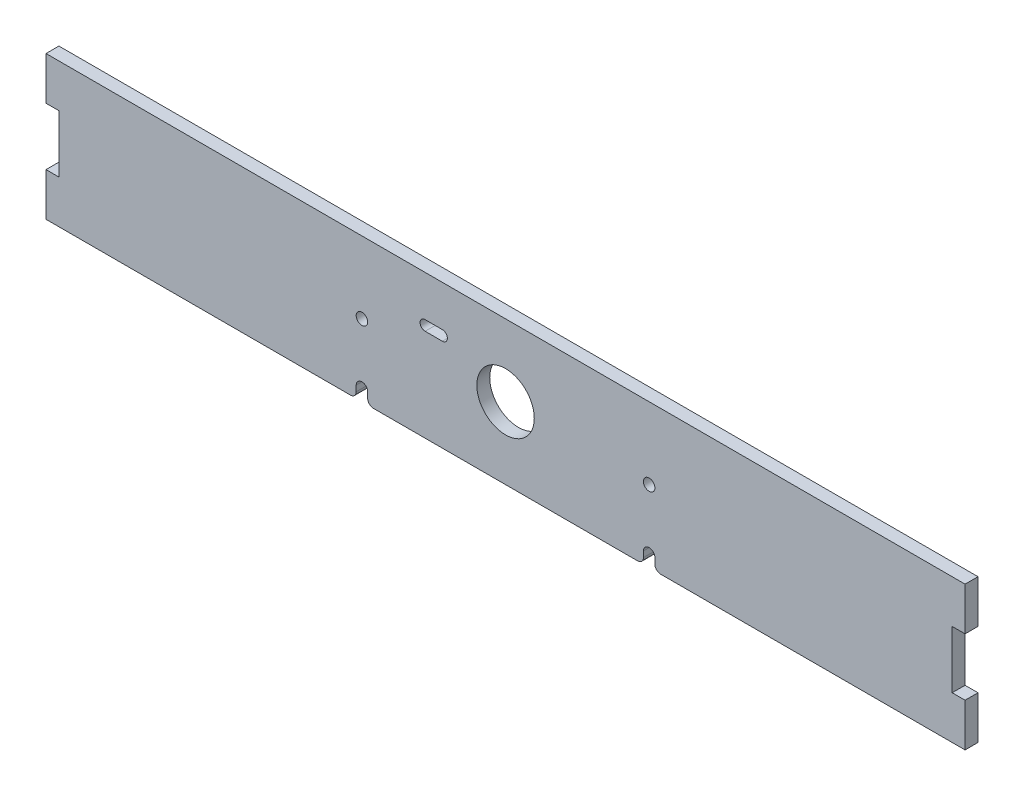
ISO-10303-21;
HEADER;
FILE_DESCRIPTION(('STEP AP214'),'2;1');
FILE_NAME('part.step','',(''),(''),'','','');
FILE_SCHEMA(('AUTOMOTIVE_DESIGN { 1 0 10303 214 1 1 1 1 }'));
ENDSEC;
DATA;
#1=APPLICATION_CONTEXT('core data for automotive mechanical design processes');
#2=APPLICATION_PROTOCOL_DEFINITION('international standard','automotive_design',2000,#1);
#3=PRODUCT_CONTEXT('',#1,'mechanical');
#4=PRODUCT('Part','Part','',(#3));
#5=PRODUCT_RELATED_PRODUCT_CATEGORY('part','',(#4));
#6=PRODUCT_DEFINITION_FORMATION('','',#4);
#7=PRODUCT_DEFINITION_CONTEXT('part definition',#1,'design');
#8=PRODUCT_DEFINITION('design','',#6,#7);
#9=PRODUCT_DEFINITION_SHAPE('','',#8);
#10=(LENGTH_UNIT() NAMED_UNIT(*) SI_UNIT(.MILLI.,.METRE.));
#11=(NAMED_UNIT(*) PLANE_ANGLE_UNIT() SI_UNIT($,.RADIAN.));
#12=(NAMED_UNIT(*) SI_UNIT($,.STERADIAN.) SOLID_ANGLE_UNIT());
#13=UNCERTAINTY_MEASURE_WITH_UNIT(LENGTH_MEASURE(1.E-05),#10,'distance_accuracy_value','');
#14=(GEOMETRIC_REPRESENTATION_CONTEXT(3) GLOBAL_UNCERTAINTY_ASSIGNED_CONTEXT((#13)) GLOBAL_UNIT_ASSIGNED_CONTEXT((#10,
#11,#12)) REPRESENTATION_CONTEXT('',''));
#15=CARTESIAN_POINT('',(0.,0.,0.));
#16=DIRECTION('',(0.,0.,1.));
#17=DIRECTION('',(1.,0.,0.));
#18=AXIS2_PLACEMENT_3D('',#15,#16,#17);
#19=CARTESIAN_POINT('',(203.2,-31.75,5.715));
#20=DIRECTION('',(-1.,0.,0.));
#21=DIRECTION('',(0.,0.,1.));
#22=AXIS2_PLACEMENT_3D('',#19,#20,#21);
#23=PLANE('',#22);
#24=DIRECTION('',(0.,0.,1.));
#25=VECTOR('',#24,1.);
#26=CARTESIAN_POINT('',(203.2,-12.7,0.));
#27=LINE('',#26,#25);
#28=CARTESIAN_POINT('',(203.2,-12.7,0.));
#29=VERTEX_POINT('',#28);
#30=CARTESIAN_POINT('',(203.2,-12.7,5.715));
#31=VERTEX_POINT('',#30);
#32=EDGE_CURVE('E450',#29,#31,#27,.T.);
#33=ORIENTED_EDGE('',*,*,#32,.T.);
#34=DIRECTION('',(0.,1.,0.));
#35=VECTOR('',#34,1.);
#36=CARTESIAN_POINT('',(203.2,-31.75,5.715));
#37=LINE('',#36,#35);
#38=CARTESIAN_POINT('',(203.2,-31.75,5.715));
#39=VERTEX_POINT('',#38);
#40=EDGE_CURVE('E369',#39,#31,#37,.T.);
#41=ORIENTED_EDGE('',*,*,#40,.F.);
#42=DIRECTION('',(0.,0.,-1.));
#43=VECTOR('',#42,1.);
#44=CARTESIAN_POINT('',(203.2,-31.75,5.715));
#45=LINE('',#44,#43);
#46=CARTESIAN_POINT('',(203.2,-31.75,0.));
#47=VERTEX_POINT('',#46);
#48=EDGE_CURVE('E259',#39,#47,#45,.T.);
#49=ORIENTED_EDGE('',*,*,#48,.T.);
#50=DIRECTION('',(0.,1.,0.));
#51=VECTOR('',#50,1.);
#52=CARTESIAN_POINT('',(203.2,-31.75,0.));
#53=LINE('',#52,#51);
#54=EDGE_CURVE('E238',#47,#29,#53,.T.);
#55=ORIENTED_EDGE('',*,*,#54,.T.);
#56=EDGE_LOOP('',(#33,#41,#49,#55));
#57=FACE_BOUND('',#56,.T.);
#58=ADVANCED_FACE('F32',(#57),#23,.F.);
#59=DIRECTION('',(0.,0.,1.));
#60=VECTOR('',#59,1.);
#61=CARTESIAN_POINT('',(203.2,12.7,0.));
#62=LINE('',#61,#60);
#63=CARTESIAN_POINT('',(203.2,12.7,0.));
#64=VERTEX_POINT('',#63);
#65=CARTESIAN_POINT('',(203.2,12.7,5.715));
#66=VERTEX_POINT('',#65);
#67=EDGE_CURVE('E217',#64,#66,#62,.T.);
#68=ORIENTED_EDGE('',*,*,#67,.F.);
#69=CARTESIAN_POINT('',(203.2,31.75,0.));
#70=VERTEX_POINT('',#69);
#71=EDGE_CURVE('E229',#64,#70,#53,.T.);
#72=ORIENTED_EDGE('',*,*,#71,.T.);
#73=DIRECTION('',(0.,0.,-1.));
#74=VECTOR('',#73,1.);
#75=CARTESIAN_POINT('',(203.2,31.75,5.715));
#76=LINE('',#75,#74);
#77=CARTESIAN_POINT('',(203.2,31.75,5.715));
#78=VERTEX_POINT('',#77);
#79=EDGE_CURVE('E268',#78,#70,#76,.T.);
#80=ORIENTED_EDGE('',*,*,#79,.F.);
#81=EDGE_CURVE('E231',#66,#78,#37,.T.);
#82=ORIENTED_EDGE('',*,*,#81,.F.);
#83=EDGE_LOOP('',(#68,#72,#80,#82));
#84=FACE_BOUND('',#83,.T.);
#85=ADVANCED_FACE('F227',(#84),#23,.F.);
#86=CARTESIAN_POINT('',(0.,0.,5.715));
#87=DIRECTION('',(0.,0.,-1.));
#88=DIRECTION('',(-1.,0.,0.));
#89=AXIS2_PLACEMENT_3D('',#86,#87,#88);
#90=PLANE('',#89);
#91=CARTESIAN_POINT('',(0.,0.,5.715));
#92=DIRECTION('',(0.,0.,1.));
#93=DIRECTION('',(1.,0.,0.));
#94=AXIS2_PLACEMENT_3D('',#91,#92,#93);
#95=CIRCLE('',#94,12.7);
#96=CARTESIAN_POINT('',(12.7,0.,5.715));
#97=VERTEX_POINT('',#96);
#98=EDGE_CURVE('E243',#97,#97,#95,.T.);
#99=ORIENTED_EDGE('',*,*,#98,.F.);
#100=EDGE_LOOP('',(#99));
#101=FACE_BOUND('',#100,.T.);
#102=CARTESIAN_POINT('',(-63.5,0.,5.715));
#103=DIRECTION('',(0.,0.,1.));
#104=DIRECTION('',(1.,0.,0.));
#105=AXIS2_PLACEMENT_3D('',#102,#103,#104);
#106=CIRCLE('',#105,2.54);
#107=CARTESIAN_POINT('',(-60.96,0.,5.715));
#108=VERTEX_POINT('',#107);
#109=EDGE_CURVE('E373',#108,#108,#106,.T.);
#110=ORIENTED_EDGE('',*,*,#109,.F.);
#111=EDGE_LOOP('',(#110));
#112=FACE_BOUND('',#111,.T.);
#113=CARTESIAN_POINT('',(63.5,0.,5.715));
#114=DIRECTION('',(0.,0.,1.));
#115=DIRECTION('',(1.,0.,0.));
#116=AXIS2_PLACEMENT_3D('',#113,#114,#115);
#117=CIRCLE('',#116,2.54);
#118=CARTESIAN_POINT('',(66.04,0.,5.715));
#119=VERTEX_POINT('',#118);
#120=EDGE_CURVE('E377',#119,#119,#117,.T.);
#121=ORIENTED_EDGE('',*,*,#120,.F.);
#122=EDGE_LOOP('',(#121));
#123=FACE_BOUND('',#122,.T.);
#124=DIRECTION('',(1.,0.,0.));
#125=VECTOR('',#124,1.);
#126=CARTESIAN_POINT('',(-35.56,9.2075,5.715));
#127=LINE('',#126,#125);
#128=CARTESIAN_POINT('',(-35.56,9.2075,5.715));
#129=VERTEX_POINT('',#128);
#130=CARTESIAN_POINT('',(-27.94,9.2075,5.715));
#131=VERTEX_POINT('',#130);
#132=EDGE_CURVE('E416',#129,#131,#127,.T.);
#133=ORIENTED_EDGE('',*,*,#132,.F.);
#134=CARTESIAN_POINT('',(-35.56,11.43,5.715));
#135=DIRECTION('',(0.,0.,1.));
#136=DIRECTION('',(1.,0.,0.));
#137=AXIS2_PLACEMENT_3D('',#134,#135,#136);
#138=CIRCLE('',#137,2.2225);
#139=CARTESIAN_POINT('',(-35.56,13.6525,5.715));
#140=VERTEX_POINT('',#139);
#141=EDGE_CURVE('E419',#140,#129,#138,.T.);
#142=ORIENTED_EDGE('',*,*,#141,.F.);
#143=DIRECTION('',(-1.,0.,0.));
#144=VECTOR('',#143,1.);
#145=CARTESIAN_POINT('',(-35.56,13.6525,5.715));
#146=LINE('',#145,#144);
#147=CARTESIAN_POINT('',(-27.94,13.6525,5.715));
#148=VERTEX_POINT('',#147);
#149=EDGE_CURVE('E409',#148,#140,#146,.T.);
#150=ORIENTED_EDGE('',*,*,#149,.F.);
#151=CARTESIAN_POINT('',(-27.94,11.43,5.715));
#152=DIRECTION('',(0.,0.,1.));
#153=DIRECTION('',(1.,0.,0.));
#154=AXIS2_PLACEMENT_3D('',#151,#152,#153);
#155=CIRCLE('',#154,2.2225);
#156=EDGE_CURVE('E413',#131,#148,#155,.T.);
#157=ORIENTED_EDGE('',*,*,#156,.F.);
#158=EDGE_LOOP('',(#133,#142,#150,#157));
#159=FACE_BOUND('',#158,.T.);
#160=DIRECTION('',(-1.,0.,0.));
#161=VECTOR('',#160,1.);
#162=CARTESIAN_POINT('',(203.2,-12.7,5.715));
#163=LINE('',#162,#161);
#164=CARTESIAN_POINT('',(197.485,-12.7,5.715));
#165=VERTEX_POINT('',#164);
#166=EDGE_CURVE('E223',#31,#165,#163,.T.);
#167=ORIENTED_EDGE('',*,*,#166,.T.);
#168=DIRECTION('',(0.,1.,0.));
#169=VECTOR('',#168,1.);
#170=CARTESIAN_POINT('',(197.485,12.7,5.715));
#171=LINE('',#170,#169);
#172=CARTESIAN_POINT('',(197.485,12.7,5.715));
#173=VERTEX_POINT('',#172);
#174=EDGE_CURVE('E462',#165,#173,#171,.T.);
#175=ORIENTED_EDGE('',*,*,#174,.T.);
#176=DIRECTION('',(1.,0.,0.));
#177=VECTOR('',#176,1.);
#178=CARTESIAN_POINT('',(203.2,12.7,5.715));
#179=LINE('',#178,#177);
#180=EDGE_CURVE('E465',#173,#66,#179,.T.);
#181=ORIENTED_EDGE('',*,*,#180,.T.);
#182=ORIENTED_EDGE('',*,*,#81,.T.);
#183=DIRECTION('',(-1.,0.,0.));
#184=VECTOR('',#183,1.);
#185=CARTESIAN_POINT('',(-203.2,31.75,5.715));
#186=LINE('',#185,#184);
#187=CARTESIAN_POINT('',(-203.2,31.75,5.715));
#188=VERTEX_POINT('',#187);
#189=EDGE_CURVE('E366',#78,#188,#186,.T.);
#190=ORIENTED_EDGE('',*,*,#189,.T.);
#191=DIRECTION('',(0.,-1.,0.));
#192=VECTOR('',#191,1.);
#193=CARTESIAN_POINT('',(-203.2,-31.75,5.715));
#194=LINE('',#193,#192);
#195=CARTESIAN_POINT('',(-203.2,12.7,5.715));
#196=VERTEX_POINT('',#195);
#197=EDGE_CURVE('E359',#188,#196,#194,.T.);
#198=ORIENTED_EDGE('',*,*,#197,.T.);
#199=DIRECTION('',(-1.,0.,0.));
#200=VECTOR('',#199,1.);
#201=CARTESIAN_POINT('',(-203.2,12.7,5.715));
#202=LINE('',#201,#200);
#203=CARTESIAN_POINT('',(-197.485,12.7,5.715));
#204=VERTEX_POINT('',#203);
#205=EDGE_CURVE('E441',#204,#196,#202,.T.);
#206=ORIENTED_EDGE('',*,*,#205,.F.);
#207=DIRECTION('',(0.,1.,0.));
#208=VECTOR('',#207,1.);
#209=CARTESIAN_POINT('',(-197.485,12.7,5.715));
#210=LINE('',#209,#208);
#211=CARTESIAN_POINT('',(-197.485,-12.7,5.715));
#212=VERTEX_POINT('',#211);
#213=EDGE_CURVE('E444',#212,#204,#210,.T.);
#214=ORIENTED_EDGE('',*,*,#213,.F.);
#215=DIRECTION('',(1.,0.,0.));
#216=VECTOR('',#215,1.);
#217=CARTESIAN_POINT('',(-203.2,-12.7,5.715));
#218=LINE('',#217,#216);
#219=CARTESIAN_POINT('',(-203.2,-12.7,5.715));
#220=VERTEX_POINT('',#219);
#221=EDGE_CURVE('E447',#220,#212,#218,.T.);
#222=ORIENTED_EDGE('',*,*,#221,.F.);
#223=CARTESIAN_POINT('',(-203.2,-31.75,5.715));
#224=VERTEX_POINT('',#223);
#225=EDGE_CURVE('E354',#220,#224,#194,.T.);
#226=ORIENTED_EDGE('',*,*,#225,.T.);
#227=DIRECTION('',(1.,0.,0.));
#228=VECTOR('',#227,1.);
#229=CARTESIAN_POINT('',(-203.2,-31.75,5.715));
#230=LINE('',#229,#228);
#231=CARTESIAN_POINT('',(-68.58,-31.75,5.715));
#232=VERTEX_POINT('',#231);
#233=EDGE_CURVE('E247',#224,#232,#230,.T.);
#234=ORIENTED_EDGE('',*,*,#233,.T.);
#235=CARTESIAN_POINT('',(-68.58,-29.21,5.715));
#236=DIRECTION('',(0.,0.,-1.));
#237=DIRECTION('',(-1.,0.,0.));
#238=AXIS2_PLACEMENT_3D('',#235,#236,#237);
#239=CIRCLE('',#238,2.54);
#240=CARTESIAN_POINT('',(-66.04,-29.21,5.715));
#241=VERTEX_POINT('',#240);
#242=EDGE_CURVE('E304',#232,#241,#239,.F.);
#243=ORIENTED_EDGE('',*,*,#242,.T.);
#244=DIRECTION('',(0.,1.,0.));
#245=VECTOR('',#244,1.);
#246=CARTESIAN_POINT('',(-66.04,0.,5.715));
#247=LINE('',#246,#245);
#248=CARTESIAN_POINT('',(-66.04,-26.67,5.715));
#249=VERTEX_POINT('',#248);
#250=EDGE_CURVE('E274',#241,#249,#247,.T.);
#251=ORIENTED_EDGE('',*,*,#250,.T.);
#252=CARTESIAN_POINT('',(-63.5,-26.67,5.715));
#253=DIRECTION('',(0.,0.,1.));
#254=DIRECTION('',(1.,0.,0.));
#255=AXIS2_PLACEMENT_3D('',#252,#253,#254);
#256=CIRCLE('',#255,2.54);
#257=CARTESIAN_POINT('',(-60.96,-26.67,5.715));
#258=VERTEX_POINT('',#257);
#259=EDGE_CURVE('E280',#258,#249,#256,.T.);
#260=ORIENTED_EDGE('',*,*,#259,.F.);
#261=DIRECTION('',(0.,-1.,0.));
#262=VECTOR('',#261,1.);
#263=CARTESIAN_POINT('',(-60.96,0.,5.715));
#264=LINE('',#263,#262);
#265=CARTESIAN_POINT('',(-60.96,-29.21,5.715));
#266=VERTEX_POINT('',#265);
#267=EDGE_CURVE('E276',#258,#266,#264,.T.);
#268=ORIENTED_EDGE('',*,*,#267,.T.);
#269=CARTESIAN_POINT('',(-58.42,-29.21,5.715));
#270=DIRECTION('',(0.,0.,-1.));
#271=DIRECTION('',(-1.,0.,0.));
#272=AXIS2_PLACEMENT_3D('',#269,#270,#271);
#273=CIRCLE('',#272,2.54);
#274=CARTESIAN_POINT('',(-58.42,-31.75,5.715));
#275=VERTEX_POINT('',#274);
#276=EDGE_CURVE('E302',#266,#275,#273,.F.);
#277=ORIENTED_EDGE('',*,*,#276,.T.);
#278=CARTESIAN_POINT('',(58.42,-31.75,5.715));
#279=VERTEX_POINT('',#278);
#280=EDGE_CURVE('E356',#275,#279,#230,.T.);
#281=ORIENTED_EDGE('',*,*,#280,.T.);
#282=CARTESIAN_POINT('',(58.42,-29.21,5.715));
#283=DIRECTION('',(0.,0.,-1.));
#284=DIRECTION('',(-1.,0.,0.));
#285=AXIS2_PLACEMENT_3D('',#282,#283,#284);
#286=CIRCLE('',#285,2.54);
#287=CARTESIAN_POINT('',(60.96,-29.21,5.715));
#288=VERTEX_POINT('',#287);
#289=EDGE_CURVE('E308',#279,#288,#286,.F.);
#290=ORIENTED_EDGE('',*,*,#289,.T.);
#291=DIRECTION('',(0.,1.,0.));
#292=VECTOR('',#291,1.);
#293=CARTESIAN_POINT('',(60.96,0.,5.715));
#294=LINE('',#293,#292);
#295=CARTESIAN_POINT('',(60.96,-26.67,5.715));
#296=VERTEX_POINT('',#295);
#297=EDGE_CURVE('E287',#288,#296,#294,.T.);
#298=ORIENTED_EDGE('',*,*,#297,.T.);
#299=CARTESIAN_POINT('',(63.5,-26.67,5.715));
#300=DIRECTION('',(0.,0.,1.));
#301=DIRECTION('',(1.,0.,0.));
#302=AXIS2_PLACEMENT_3D('',#299,#300,#301);
#303=CIRCLE('',#302,2.54000000000001);
#304=CARTESIAN_POINT('',(66.04,-26.67,5.715));
#305=VERTEX_POINT('',#304);
#306=EDGE_CURVE('E293',#305,#296,#303,.T.);
#307=ORIENTED_EDGE('',*,*,#306,.F.);
#308=DIRECTION('',(0.,-1.,0.));
#309=VECTOR('',#308,1.);
#310=CARTESIAN_POINT('',(66.04,0.,5.715));
#311=LINE('',#310,#309);
#312=CARTESIAN_POINT('',(66.04,-29.21,5.715));
#313=VERTEX_POINT('',#312);
#314=EDGE_CURVE('E289',#305,#313,#311,.T.);
#315=ORIENTED_EDGE('',*,*,#314,.T.);
#316=CARTESIAN_POINT('',(68.58,-29.21,5.715));
#317=DIRECTION('',(0.,0.,-1.));
#318=DIRECTION('',(-1.,0.,0.));
#319=AXIS2_PLACEMENT_3D('',#316,#317,#318);
#320=CIRCLE('',#319,2.54);
#321=CARTESIAN_POINT('',(68.58,-31.75,5.715));
#322=VERTEX_POINT('',#321);
#323=EDGE_CURVE('E306',#313,#322,#320,.F.);
#324=ORIENTED_EDGE('',*,*,#323,.T.);
#325=EDGE_CURVE('E357',#322,#39,#230,.T.);
#326=ORIENTED_EDGE('',*,*,#325,.T.);
#327=ORIENTED_EDGE('',*,*,#40,.T.);
#328=EDGE_LOOP('',(#167,#175,#181,#182,#190,#198,#206,#214,#222,#226,#234,#243,#251,#260,#268,
#277,#281,#290,#298,#307,#315,#324,#326,#327));
#329=FACE_BOUND('',#328,.T.);
#330=ADVANCED_FACE('F351',(#101,#112,#123,#159,#329),#90,.F.);
#331=CARTESIAN_POINT('',(0.,0.,0.));
#332=DIRECTION('',(0.,0.,-1.));
#333=DIRECTION('',(-1.,0.,0.));
#334=AXIS2_PLACEMENT_3D('',#331,#332,#333);
#335=PLANE('',#334);
#336=CARTESIAN_POINT('',(-35.56,11.43,0.));
#337=DIRECTION('',(0.,0.,1.));
#338=DIRECTION('',(1.,0.,0.));
#339=AXIS2_PLACEMENT_3D('',#336,#337,#338);
#340=CIRCLE('',#339,2.2225);
#341=CARTESIAN_POINT('',(-35.56,13.6525,0.));
#342=VERTEX_POINT('',#341);
#343=CARTESIAN_POINT('',(-35.56,9.2075,0.));
#344=VERTEX_POINT('',#343);
#345=EDGE_CURVE('E412',#342,#344,#340,.T.);
#346=ORIENTED_EDGE('',*,*,#345,.T.);
#347=DIRECTION('',(1.,0.,0.));
#348=VECTOR('',#347,1.);
#349=CARTESIAN_POINT('',(-35.56,9.2075,0.));
#350=LINE('',#349,#348);
#351=CARTESIAN_POINT('',(-27.94,9.2075,0.));
#352=VERTEX_POINT('',#351);
#353=EDGE_CURVE('E427',#344,#352,#350,.T.);
#354=ORIENTED_EDGE('',*,*,#353,.T.);
#355=CARTESIAN_POINT('',(-27.94,11.43,0.));
#356=DIRECTION('',(0.,0.,1.));
#357=DIRECTION('',(1.,0.,0.));
#358=AXIS2_PLACEMENT_3D('',#355,#356,#357);
#359=CIRCLE('',#358,2.2225);
#360=CARTESIAN_POINT('',(-27.94,13.6525,0.));
#361=VERTEX_POINT('',#360);
#362=EDGE_CURVE('E424',#352,#361,#359,.T.);
#363=ORIENTED_EDGE('',*,*,#362,.T.);
#364=DIRECTION('',(-1.,0.,0.));
#365=VECTOR('',#364,1.);
#366=CARTESIAN_POINT('',(-35.56,13.6525,0.));
#367=LINE('',#366,#365);
#368=EDGE_CURVE('E404',#361,#342,#367,.T.);
#369=ORIENTED_EDGE('',*,*,#368,.T.);
#370=EDGE_LOOP('',(#346,#354,#363,#369));
#371=FACE_BOUND('',#370,.T.);
#372=CARTESIAN_POINT('',(63.5,0.,0.));
#373=DIRECTION('',(0.,0.,1.));
#374=DIRECTION('',(1.,0.,0.));
#375=AXIS2_PLACEMENT_3D('',#372,#373,#374);
#376=CIRCLE('',#375,2.54);
#377=CARTESIAN_POINT('',(66.04,0.,0.));
#378=VERTEX_POINT('',#377);
#379=EDGE_CURVE('E283',#378,#378,#376,.T.);
#380=ORIENTED_EDGE('',*,*,#379,.T.);
#381=EDGE_LOOP('',(#380));
#382=FACE_BOUND('',#381,.T.);
#383=CARTESIAN_POINT('',(-63.5,0.,0.));
#384=DIRECTION('',(0.,0.,1.));
#385=DIRECTION('',(1.,0.,0.));
#386=AXIS2_PLACEMENT_3D('',#383,#384,#385);
#387=CIRCLE('',#386,2.54);
#388=CARTESIAN_POINT('',(-60.96,0.,0.));
#389=VERTEX_POINT('',#388);
#390=EDGE_CURVE('E374',#389,#389,#387,.T.);
#391=ORIENTED_EDGE('',*,*,#390,.T.);
#392=EDGE_LOOP('',(#391));
#393=FACE_BOUND('',#392,.T.);
#394=CARTESIAN_POINT('',(0.,0.,0.));
#395=DIRECTION('',(0.,0.,-1.));
#396=DIRECTION('',(-1.,0.,0.));
#397=AXIS2_PLACEMENT_3D('',#394,#395,#396);
#398=CIRCLE('',#397,12.7);
#399=CARTESIAN_POINT('',(-12.7,0.,0.));
#400=VERTEX_POINT('',#399);
#401=EDGE_CURVE('E239',#400,#400,#398,.F.);
#402=ORIENTED_EDGE('',*,*,#401,.T.);
#403=EDGE_LOOP('',(#402));
#404=FACE_BOUND('',#403,.T.);
#405=DIRECTION('',(0.,1.,0.));
#406=VECTOR('',#405,1.);
#407=CARTESIAN_POINT('',(197.485,12.7,0.));
#408=LINE('',#407,#406);
#409=CARTESIAN_POINT('',(197.485,-12.7,0.));
#410=VERTEX_POINT('',#409);
#411=CARTESIAN_POINT('',(197.485,12.7,0.));
#412=VERTEX_POINT('',#411);
#413=EDGE_CURVE('E222',#410,#412,#408,.T.);
#414=ORIENTED_EDGE('',*,*,#413,.F.);
#415=DIRECTION('',(-1.,0.,0.));
#416=VECTOR('',#415,1.);
#417=CARTESIAN_POINT('',(203.2,-12.7,0.));
#418=LINE('',#417,#416);
#419=EDGE_CURVE('E232',#29,#410,#418,.T.);
#420=ORIENTED_EDGE('',*,*,#419,.F.);
#421=ORIENTED_EDGE('',*,*,#54,.F.);
#422=DIRECTION('',(1.,0.,0.));
#423=VECTOR('',#422,1.);
#424=CARTESIAN_POINT('',(-203.2,-31.75,0.));
#425=LINE('',#424,#423);
#426=CARTESIAN_POINT('',(68.58,-31.75,0.));
#427=VERTEX_POINT('',#426);
#428=EDGE_CURVE('E254',#427,#47,#425,.T.);
#429=ORIENTED_EDGE('',*,*,#428,.F.);
#430=CARTESIAN_POINT('',(68.58,-29.21,0.));
#431=DIRECTION('',(0.,0.,-1.));
#432=DIRECTION('',(-1.,0.,0.));
#433=AXIS2_PLACEMENT_3D('',#430,#431,#432);
#434=CIRCLE('',#433,2.54);
#435=CARTESIAN_POINT('',(66.04,-29.21,0.));
#436=VERTEX_POINT('',#435);
#437=EDGE_CURVE('E316',#427,#436,#434,.T.);
#438=ORIENTED_EDGE('',*,*,#437,.T.);
#439=DIRECTION('',(0.,-1.,0.));
#440=VECTOR('',#439,1.);
#441=CARTESIAN_POINT('',(66.04,0.,0.));
#442=LINE('',#441,#440);
#443=CARTESIAN_POINT('',(66.04,-26.67,0.));
#444=VERTEX_POINT('',#443);
#445=EDGE_CURVE('E273',#444,#436,#442,.T.);
#446=ORIENTED_EDGE('',*,*,#445,.F.);
#447=CARTESIAN_POINT('',(63.5,-26.67,0.));
#448=DIRECTION('',(0.,0.,1.));
#449=DIRECTION('',(1.,0.,0.));
#450=AXIS2_PLACEMENT_3D('',#447,#448,#449);
#451=CIRCLE('',#450,2.54000000000001);
#452=CARTESIAN_POINT('',(60.96,-26.67,0.));
#453=VERTEX_POINT('',#452);
#454=EDGE_CURVE('E396',#444,#453,#451,.T.);
#455=ORIENTED_EDGE('',*,*,#454,.T.);
#456=DIRECTION('',(0.,-1.,0.));
#457=VECTOR('',#456,1.);
#458=CARTESIAN_POINT('',(60.96,-26.67,0.));
#459=LINE('',#458,#457);
#460=CARTESIAN_POINT('',(60.96,-29.21,0.));
#461=VERTEX_POINT('',#460);
#462=EDGE_CURVE('E391',#453,#461,#459,.T.);
#463=ORIENTED_EDGE('',*,*,#462,.T.);
#464=CARTESIAN_POINT('',(58.42,-29.21,0.));
#465=DIRECTION('',(0.,0.,-1.));
#466=DIRECTION('',(-1.,0.,0.));
#467=AXIS2_PLACEMENT_3D('',#464,#465,#466);
#468=CIRCLE('',#467,2.54);
#469=CARTESIAN_POINT('',(58.42,-31.75,0.));
#470=VERTEX_POINT('',#469);
#471=EDGE_CURVE('E318',#461,#470,#468,.T.);
#472=ORIENTED_EDGE('',*,*,#471,.T.);
#473=CARTESIAN_POINT('',(-58.42,-31.75,0.));
#474=VERTEX_POINT('',#473);
#475=EDGE_CURVE('E258',#474,#470,#425,.T.);
#476=ORIENTED_EDGE('',*,*,#475,.F.);
#477=CARTESIAN_POINT('',(-58.42,-29.21,0.));
#478=DIRECTION('',(0.,0.,-1.));
#479=DIRECTION('',(-1.,0.,0.));
#480=AXIS2_PLACEMENT_3D('',#477,#478,#479);
#481=CIRCLE('',#480,2.54);
#482=CARTESIAN_POINT('',(-60.96,-29.21,0.));
#483=VERTEX_POINT('',#482);
#484=EDGE_CURVE('E312',#474,#483,#481,.T.);
#485=ORIENTED_EDGE('',*,*,#484,.T.);
#486=DIRECTION('',(0.,-1.,0.));
#487=VECTOR('',#486,1.);
#488=CARTESIAN_POINT('',(-60.96,0.,0.));
#489=LINE('',#488,#487);
#490=CARTESIAN_POINT('',(-60.96,-26.67,0.));
#491=VERTEX_POINT('',#490);
#492=EDGE_CURVE('E269',#491,#483,#489,.T.);
#493=ORIENTED_EDGE('',*,*,#492,.F.);
#494=CARTESIAN_POINT('',(-63.5,-26.67,0.));
#495=DIRECTION('',(0.,0.,1.));
#496=DIRECTION('',(1.,0.,0.));
#497=AXIS2_PLACEMENT_3D('',#494,#495,#496);
#498=CIRCLE('',#497,2.54);
#499=CARTESIAN_POINT('',(-66.04,-26.67,0.));
#500=VERTEX_POINT('',#499);
#501=EDGE_CURVE('E296',#491,#500,#498,.T.);
#502=ORIENTED_EDGE('',*,*,#501,.T.);
#503=DIRECTION('',(0.,-1.,0.));
#504=VECTOR('',#503,1.);
#505=CARTESIAN_POINT('',(-66.04,-26.67,0.));
#506=LINE('',#505,#504);
#507=CARTESIAN_POINT('',(-66.04,-29.21,0.));
#508=VERTEX_POINT('',#507);
#509=EDGE_CURVE('E334',#500,#508,#506,.T.);
#510=ORIENTED_EDGE('',*,*,#509,.T.);
#511=CARTESIAN_POINT('',(-68.58,-29.21,0.));
#512=DIRECTION('',(0.,0.,-1.));
#513=DIRECTION('',(-1.,0.,0.));
#514=AXIS2_PLACEMENT_3D('',#511,#512,#513);
#515=CIRCLE('',#514,2.54);
#516=CARTESIAN_POINT('',(-68.58,-31.75,0.));
#517=VERTEX_POINT('',#516);
#518=EDGE_CURVE('E314',#508,#517,#515,.T.);
#519=ORIENTED_EDGE('',*,*,#518,.T.);
#520=CARTESIAN_POINT('',(-203.2,-31.75,0.));
#521=VERTEX_POINT('',#520);
#522=EDGE_CURVE('E255',#521,#517,#425,.T.);
#523=ORIENTED_EDGE('',*,*,#522,.F.);
#524=DIRECTION('',(0.,-1.,0.));
#525=VECTOR('',#524,1.);
#526=CARTESIAN_POINT('',(-203.2,-31.75,0.));
#527=LINE('',#526,#525);
#528=CARTESIAN_POINT('',(-203.2,-12.7,0.));
#529=VERTEX_POINT('',#528);
#530=EDGE_CURVE('E250',#529,#521,#527,.T.);
#531=ORIENTED_EDGE('',*,*,#530,.F.);
#532=DIRECTION('',(1.,0.,0.));
#533=VECTOR('',#532,1.);
#534=CARTESIAN_POINT('',(-203.2,-12.7,0.));
#535=LINE('',#534,#533);
#536=CARTESIAN_POINT('',(-197.485,-12.7,0.));
#537=VERTEX_POINT('',#536);
#538=EDGE_CURVE('E443',#529,#537,#535,.T.);
#539=ORIENTED_EDGE('',*,*,#538,.T.);
#540=DIRECTION('',(0.,1.,0.));
#541=VECTOR('',#540,1.);
#542=CARTESIAN_POINT('',(-197.485,12.7,0.));
#543=LINE('',#542,#541);
#544=CARTESIAN_POINT('',(-197.485,12.7,0.));
#545=VERTEX_POINT('',#544);
#546=EDGE_CURVE('E55',#537,#545,#543,.T.);
#547=ORIENTED_EDGE('',*,*,#546,.T.);
#548=DIRECTION('',(-1.,0.,0.));
#549=VECTOR('',#548,1.);
#550=CARTESIAN_POINT('',(-203.2,12.7,0.));
#551=LINE('',#550,#549);
#552=CARTESIAN_POINT('',(-203.2,12.7,0.));
#553=VERTEX_POINT('',#552);
#554=EDGE_CURVE('E435',#545,#553,#551,.T.);
#555=ORIENTED_EDGE('',*,*,#554,.T.);
#556=CARTESIAN_POINT('',(-203.2,31.75,0.));
#557=VERTEX_POINT('',#556);
#558=EDGE_CURVE('E251',#557,#553,#527,.T.);
#559=ORIENTED_EDGE('',*,*,#558,.F.);
#560=DIRECTION('',(-1.,0.,0.));
#561=VECTOR('',#560,1.);
#562=CARTESIAN_POINT('',(-203.2,31.75,0.));
#563=LINE('',#562,#561);
#564=EDGE_CURVE('E236',#70,#557,#563,.T.);
#565=ORIENTED_EDGE('',*,*,#564,.F.);
#566=ORIENTED_EDGE('',*,*,#71,.F.);
#567=DIRECTION('',(1.,0.,0.));
#568=VECTOR('',#567,1.);
#569=CARTESIAN_POINT('',(203.2,12.7,0.));
#570=LINE('',#569,#568);
#571=EDGE_CURVE('E214',#412,#64,#570,.T.);
#572=ORIENTED_EDGE('',*,*,#571,.F.);
#573=EDGE_LOOP('',(#414,#420,#421,#429,#438,#446,#455,#463,#472,#476,#485,#493,#502,#510,#519,
#523,#531,#539,#547,#555,#559,#565,#566,#572));
#574=FACE_BOUND('',#573,.T.);
#575=ADVANCED_FACE('F234',(#371,#382,#393,#404,#574),#335,.T.);
#576=CARTESIAN_POINT('',(-203.2,-31.75,5.715));
#577=DIRECTION('',(1.,0.,0.));
#578=DIRECTION('',(0.,0.,-1.));
#579=AXIS2_PLACEMENT_3D('',#576,#577,#578);
#580=PLANE('',#579);
#581=ORIENTED_EDGE('',*,*,#558,.T.);
#582=DIRECTION('',(0.,0.,1.));
#583=VECTOR('',#582,1.);
#584=CARTESIAN_POINT('',(-203.2,12.7,0.));
#585=LINE('',#584,#583);
#586=EDGE_CURVE('E421',#553,#196,#585,.T.);
#587=ORIENTED_EDGE('',*,*,#586,.T.);
#588=ORIENTED_EDGE('',*,*,#197,.F.);
#589=DIRECTION('',(0.,0.,-1.));
#590=VECTOR('',#589,1.);
#591=CARTESIAN_POINT('',(-203.2,31.75,5.715));
#592=LINE('',#591,#590);
#593=EDGE_CURVE('E265',#188,#557,#592,.T.);
#594=ORIENTED_EDGE('',*,*,#593,.T.);
#595=EDGE_LOOP('',(#581,#587,#588,#594));
#596=FACE_BOUND('',#595,.T.);
#597=ADVANCED_FACE('F571',(#596),#580,.F.);
#598=CARTESIAN_POINT('',(-203.2,-31.75,5.715));
#599=DIRECTION('',(0.,1.,0.));
#600=DIRECTION('',(0.,0.,1.));
#601=AXIS2_PLACEMENT_3D('',#598,#599,#600);
#602=PLANE('',#601);
#603=ORIENTED_EDGE('',*,*,#325,.F.);
#604=DIRECTION('',(0.,0.,-1.));
#605=VECTOR('',#604,1.);
#606=CARTESIAN_POINT('',(68.58,-31.75,5.715));
#607=LINE('',#606,#605);
#608=EDGE_CURVE('E320',#322,#427,#607,.T.);
#609=ORIENTED_EDGE('',*,*,#608,.T.);
#610=ORIENTED_EDGE('',*,*,#428,.T.);
#611=ORIENTED_EDGE('',*,*,#48,.F.);
#612=EDGE_LOOP('',(#603,#609,#610,#611));
#613=FACE_BOUND('',#612,.T.);
#614=ADVANCED_FACE('F479',(#613),#602,.F.);
#615=ORIENTED_EDGE('',*,*,#475,.T.);
#616=DIRECTION('',(0.,0.,1.));
#617=VECTOR('',#616,1.);
#618=CARTESIAN_POINT('',(58.42,-31.75,5.715));
#619=LINE('',#618,#617);
#620=EDGE_CURVE('E299',#470,#279,#619,.T.);
#621=ORIENTED_EDGE('',*,*,#620,.T.);
#622=ORIENTED_EDGE('',*,*,#280,.F.);
#623=DIRECTION('',(0.,0.,-1.));
#624=VECTOR('',#623,1.);
#625=CARTESIAN_POINT('',(-58.42,-31.75,5.715));
#626=LINE('',#625,#624);
#627=EDGE_CURVE('E286',#275,#474,#626,.T.);
#628=ORIENTED_EDGE('',*,*,#627,.T.);
#629=EDGE_LOOP('',(#615,#621,#622,#628));
#630=FACE_BOUND('',#629,.T.);
#631=ADVANCED_FACE('F485',(#630),#602,.F.);
#632=CARTESIAN_POINT('',(-203.2,31.75,5.715));
#633=DIRECTION('',(0.,-1.,0.));
#634=DIRECTION('',(0.,0.,-1.));
#635=AXIS2_PLACEMENT_3D('',#632,#633,#634);
#636=PLANE('',#635);
#637=ORIENTED_EDGE('',*,*,#564,.T.);
#638=ORIENTED_EDGE('',*,*,#593,.F.);
#639=ORIENTED_EDGE('',*,*,#189,.F.);
#640=ORIENTED_EDGE('',*,*,#79,.T.);
#641=EDGE_LOOP('',(#637,#638,#639,#640));
#642=FACE_BOUND('',#641,.T.);
#643=ADVANCED_FACE('F523',(#642),#636,.F.);
#644=ORIENTED_EDGE('',*,*,#225,.F.);
#645=DIRECTION('',(0.,0.,1.));
#646=VECTOR('',#645,1.);
#647=CARTESIAN_POINT('',(-203.2,-12.7,0.));
#648=LINE('',#647,#646);
#649=EDGE_CURVE('E432',#529,#220,#648,.T.);
#650=ORIENTED_EDGE('',*,*,#649,.F.);
#651=ORIENTED_EDGE('',*,*,#530,.T.);
#652=DIRECTION('',(0.,0.,-1.));
#653=VECTOR('',#652,1.);
#654=CARTESIAN_POINT('',(-203.2,-31.75,5.715));
#655=LINE('',#654,#653);
#656=EDGE_CURVE('E262',#224,#521,#655,.T.);
#657=ORIENTED_EDGE('',*,*,#656,.F.);
#658=EDGE_LOOP('',(#644,#650,#651,#657));
#659=FACE_BOUND('',#658,.T.);
#660=ADVANCED_FACE('F574',(#659),#580,.F.);
#661=ORIENTED_EDGE('',*,*,#522,.T.);
#662=DIRECTION('',(0.,0.,1.));
#663=VECTOR('',#662,1.);
#664=CARTESIAN_POINT('',(-68.58,-31.75,5.715));
#665=LINE('',#664,#663);
#666=EDGE_CURVE('E325',#517,#232,#665,.T.);
#667=ORIENTED_EDGE('',*,*,#666,.T.);
#668=ORIENTED_EDGE('',*,*,#233,.F.);
#669=ORIENTED_EDGE('',*,*,#656,.T.);
#670=EDGE_LOOP('',(#661,#667,#668,#669));
#671=FACE_BOUND('',#670,.T.);
#672=ADVANCED_FACE('F348',(#671),#602,.F.);
#673=CARTESIAN_POINT('',(0.,0.,5.715));
#674=DIRECTION('',(0.,0.,-1.));
#675=DIRECTION('',(-1.,0.,0.));
#676=AXIS2_PLACEMENT_3D('',#673,#674,#675);
#677=CYLINDRICAL_SURFACE('',#676,12.7);
#678=ORIENTED_EDGE('',*,*,#401,.F.);
#679=EDGE_LOOP('',(#678));
#680=FACE_BOUND('',#679,.T.);
#681=ORIENTED_EDGE('',*,*,#98,.T.);
#682=EDGE_LOOP('',(#681));
#683=FACE_BOUND('',#682,.T.);
#684=ADVANCED_FACE('F561',(#680,#683),#677,.F.);
#685=CARTESIAN_POINT('',(-63.5,0.,5.715));
#686=DIRECTION('',(0.,0.,-1.));
#687=DIRECTION('',(-1.,0.,0.));
#688=AXIS2_PLACEMENT_3D('',#685,#686,#687);
#689=CYLINDRICAL_SURFACE('',#688,2.54);
#690=ORIENTED_EDGE('',*,*,#109,.T.);
#691=EDGE_LOOP('',(#690));
#692=FACE_BOUND('',#691,.T.);
#693=ORIENTED_EDGE('',*,*,#390,.F.);
#694=EDGE_LOOP('',(#693));
#695=FACE_BOUND('',#694,.T.);
#696=ADVANCED_FACE('F554',(#692,#695),#689,.F.);
#697=CARTESIAN_POINT('',(63.5,0.,5.715));
#698=DIRECTION('',(0.,0.,-1.));
#699=DIRECTION('',(-1.,0.,0.));
#700=AXIS2_PLACEMENT_3D('',#697,#698,#699);
#701=CYLINDRICAL_SURFACE('',#700,2.54);
#702=ORIENTED_EDGE('',*,*,#120,.T.);
#703=EDGE_LOOP('',(#702));
#704=FACE_BOUND('',#703,.T.);
#705=ORIENTED_EDGE('',*,*,#379,.F.);
#706=EDGE_LOOP('',(#705));
#707=FACE_BOUND('',#706,.T.);
#708=ADVANCED_FACE('F547',(#704,#707),#701,.F.);
#709=CARTESIAN_POINT('',(-63.5,-26.67,0.));
#710=DIRECTION('',(0.,0.,1.));
#711=DIRECTION('',(1.,0.,0.));
#712=AXIS2_PLACEMENT_3D('',#709,#710,#711);
#713=CYLINDRICAL_SURFACE('',#712,2.54);
#714=DIRECTION('',(0.,0.,1.));
#715=VECTOR('',#714,1.);
#716=CARTESIAN_POINT('',(-66.04,-26.67,0.));
#717=LINE('',#716,#715);
#718=EDGE_CURVE('E341',#500,#249,#717,.T.);
#719=ORIENTED_EDGE('',*,*,#718,.F.);
#720=ORIENTED_EDGE('',*,*,#501,.F.);
#721=DIRECTION('',(0.,0.,1.));
#722=VECTOR('',#721,1.);
#723=CARTESIAN_POINT('',(-60.96,-26.67,0.));
#724=LINE('',#723,#722);
#725=EDGE_CURVE('E277',#491,#258,#724,.T.);
#726=ORIENTED_EDGE('',*,*,#725,.T.);
#727=ORIENTED_EDGE('',*,*,#259,.T.);
#728=EDGE_LOOP('',(#719,#720,#726,#727));
#729=FACE_BOUND('',#728,.T.);
#730=ADVANCED_FACE('F545',(#729),#713,.F.);
#731=CARTESIAN_POINT('',(-60.96,-26.67,0.));
#732=DIRECTION('',(1.,0.,0.));
#733=DIRECTION('',(0.,0.,-1.));
#734=AXIS2_PLACEMENT_3D('',#731,#732,#733);
#735=PLANE('',#734);
#736=ORIENTED_EDGE('',*,*,#492,.T.);
#737=DIRECTION('',(0.,0.,-1.));
#738=VECTOR('',#737,1.);
#739=CARTESIAN_POINT('',(-60.96,-29.21,0.));
#740=LINE('',#739,#738);
#741=EDGE_CURVE('E11',#483,#266,#740,.F.);
#742=ORIENTED_EDGE('',*,*,#741,.T.);
#743=ORIENTED_EDGE('',*,*,#267,.F.);
#744=ORIENTED_EDGE('',*,*,#725,.F.);
#745=EDGE_LOOP('',(#736,#742,#743,#744));
#746=FACE_BOUND('',#745,.T.);
#747=ADVANCED_FACE('F543',(#746),#735,.F.);
#748=CARTESIAN_POINT('',(-66.04,-26.67,0.));
#749=DIRECTION('',(-1.,0.,0.));
#750=DIRECTION('',(0.,0.,1.));
#751=AXIS2_PLACEMENT_3D('',#748,#749,#750);
#752=PLANE('',#751);
#753=ORIENTED_EDGE('',*,*,#250,.F.);
#754=DIRECTION('',(0.,0.,1.));
#755=VECTOR('',#754,1.);
#756=CARTESIAN_POINT('',(-66.04,-29.21,0.));
#757=LINE('',#756,#755);
#758=EDGE_CURVE('E40',#241,#508,#757,.F.);
#759=ORIENTED_EDGE('',*,*,#758,.T.);
#760=ORIENTED_EDGE('',*,*,#509,.F.);
#761=ORIENTED_EDGE('',*,*,#718,.T.);
#762=EDGE_LOOP('',(#753,#759,#760,#761));
#763=FACE_BOUND('',#762,.T.);
#764=ADVANCED_FACE('F332',(#763),#752,.F.);
#765=CARTESIAN_POINT('',(63.5,-26.67,0.));
#766=DIRECTION('',(0.,0.,1.));
#767=DIRECTION('',(1.,0.,0.));
#768=AXIS2_PLACEMENT_3D('',#765,#766,#767);
#769=CYLINDRICAL_SURFACE('',#768,2.54000000000001);
#770=DIRECTION('',(0.,0.,1.));
#771=VECTOR('',#770,1.);
#772=CARTESIAN_POINT('',(60.96,-26.67,0.));
#773=LINE('',#772,#771);
#774=EDGE_CURVE('E388',#453,#296,#773,.T.);
#775=ORIENTED_EDGE('',*,*,#774,.F.);
#776=ORIENTED_EDGE('',*,*,#454,.F.);
#777=DIRECTION('',(0.,0.,1.));
#778=VECTOR('',#777,1.);
#779=CARTESIAN_POINT('',(66.04,-26.67,0.));
#780=LINE('',#779,#778);
#781=EDGE_CURVE('E290',#444,#305,#780,.T.);
#782=ORIENTED_EDGE('',*,*,#781,.T.);
#783=ORIENTED_EDGE('',*,*,#306,.T.);
#784=EDGE_LOOP('',(#775,#776,#782,#783));
#785=FACE_BOUND('',#784,.T.);
#786=ADVANCED_FACE('F499',(#785),#769,.F.);
#787=CARTESIAN_POINT('',(66.04,-26.67,0.));
#788=DIRECTION('',(1.,0.,0.));
#789=DIRECTION('',(0.,0.,-1.));
#790=AXIS2_PLACEMENT_3D('',#787,#788,#789);
#791=PLANE('',#790);
#792=ORIENTED_EDGE('',*,*,#445,.T.);
#793=DIRECTION('',(0.,0.,-1.));
#794=VECTOR('',#793,1.);
#795=CARTESIAN_POINT('',(66.04,-29.21,0.));
#796=LINE('',#795,#794);
#797=EDGE_CURVE('E323',#436,#313,#796,.F.);
#798=ORIENTED_EDGE('',*,*,#797,.T.);
#799=ORIENTED_EDGE('',*,*,#314,.F.);
#800=ORIENTED_EDGE('',*,*,#781,.F.);
#801=EDGE_LOOP('',(#792,#798,#799,#800));
#802=FACE_BOUND('',#801,.T.);
#803=ADVANCED_FACE('F506',(#802),#791,.F.);
#804=CARTESIAN_POINT('',(60.96,-26.67,0.));
#805=DIRECTION('',(-1.,0.,0.));
#806=DIRECTION('',(0.,0.,1.));
#807=AXIS2_PLACEMENT_3D('',#804,#805,#806);
#808=PLANE('',#807);
#809=ORIENTED_EDGE('',*,*,#297,.F.);
#810=DIRECTION('',(0.,0.,1.));
#811=VECTOR('',#810,1.);
#812=CARTESIAN_POINT('',(60.96,-29.21,0.));
#813=LINE('',#812,#811);
#814=EDGE_CURVE('E310',#288,#461,#813,.F.);
#815=ORIENTED_EDGE('',*,*,#814,.T.);
#816=ORIENTED_EDGE('',*,*,#462,.F.);
#817=ORIENTED_EDGE('',*,*,#774,.T.);
#818=EDGE_LOOP('',(#809,#815,#816,#817));
#819=FACE_BOUND('',#818,.T.);
#820=ADVANCED_FACE('F495',(#819),#808,.F.);
#821=CARTESIAN_POINT('',(58.42,-29.21,5.715));
#822=DIRECTION('',(0.,0.,1.));
#823=DIRECTION('',(1.,0.,0.));
#824=AXIS2_PLACEMENT_3D('',#821,#822,#823);
#825=CYLINDRICAL_SURFACE('',#824,2.54);
#826=ORIENTED_EDGE('',*,*,#471,.F.);
#827=ORIENTED_EDGE('',*,*,#814,.F.);
#828=ORIENTED_EDGE('',*,*,#289,.F.);
#829=ORIENTED_EDGE('',*,*,#620,.F.);
#830=EDGE_LOOP('',(#826,#827,#828,#829));
#831=FACE_BOUND('',#830,.T.);
#832=ADVANCED_FACE('F490',(#831),#825,.T.);
#833=CARTESIAN_POINT('',(68.58,-29.21,5.715));
#834=DIRECTION('',(0.,0.,-1.));
#835=DIRECTION('',(-1.,0.,0.));
#836=AXIS2_PLACEMENT_3D('',#833,#834,#835);
#837=CYLINDRICAL_SURFACE('',#836,2.54);
#838=ORIENTED_EDGE('',*,*,#323,.F.);
#839=ORIENTED_EDGE('',*,*,#797,.F.);
#840=ORIENTED_EDGE('',*,*,#437,.F.);
#841=ORIENTED_EDGE('',*,*,#608,.F.);
#842=EDGE_LOOP('',(#838,#839,#840,#841));
#843=FACE_BOUND('',#842,.T.);
#844=ADVANCED_FACE('F505',(#843),#837,.T.);
#845=CARTESIAN_POINT('',(-68.58,-29.21,5.715));
#846=DIRECTION('',(0.,0.,1.));
#847=DIRECTION('',(1.,0.,0.));
#848=AXIS2_PLACEMENT_3D('',#845,#846,#847);
#849=CYLINDRICAL_SURFACE('',#848,2.54);
#850=ORIENTED_EDGE('',*,*,#518,.F.);
#851=ORIENTED_EDGE('',*,*,#758,.F.);
#852=ORIENTED_EDGE('',*,*,#242,.F.);
#853=ORIENTED_EDGE('',*,*,#666,.F.);
#854=EDGE_LOOP('',(#850,#851,#852,#853));
#855=FACE_BOUND('',#854,.T.);
#856=ADVANCED_FACE('F344',(#855),#849,.T.);
#857=CARTESIAN_POINT('',(-58.42,-29.21,5.715));
#858=DIRECTION('',(0.,0.,-1.));
#859=DIRECTION('',(-1.,0.,0.));
#860=AXIS2_PLACEMENT_3D('',#857,#858,#859);
#861=CYLINDRICAL_SURFACE('',#860,2.54);
#862=ORIENTED_EDGE('',*,*,#276,.F.);
#863=ORIENTED_EDGE('',*,*,#741,.F.);
#864=ORIENTED_EDGE('',*,*,#484,.F.);
#865=ORIENTED_EDGE('',*,*,#627,.F.);
#866=EDGE_LOOP('',(#862,#863,#864,#865));
#867=FACE_BOUND('',#866,.T.);
#868=ADVANCED_FACE('F34',(#867),#861,.T.);
#869=CARTESIAN_POINT('',(-35.56,11.43,0.));
#870=DIRECTION('',(0.,0.,1.));
#871=DIRECTION('',(1.,0.,0.));
#872=AXIS2_PLACEMENT_3D('',#869,#870,#871);
#873=CYLINDRICAL_SURFACE('',#872,2.2225);
#874=ORIENTED_EDGE('',*,*,#141,.T.);
#875=DIRECTION('',(0.,0.,1.));
#876=VECTOR('',#875,1.);
#877=CARTESIAN_POINT('',(-35.56,9.2075,0.));
#878=LINE('',#877,#876);
#879=EDGE_CURVE('E400',#344,#129,#878,.T.);
#880=ORIENTED_EDGE('',*,*,#879,.F.);
#881=ORIENTED_EDGE('',*,*,#345,.F.);
#882=DIRECTION('',(0.,0.,1.));
#883=VECTOR('',#882,1.);
#884=CARTESIAN_POINT('',(-35.56,13.6525,0.));
#885=LINE('',#884,#883);
#886=EDGE_CURVE('E399',#342,#140,#885,.T.);
#887=ORIENTED_EDGE('',*,*,#886,.T.);
#888=EDGE_LOOP('',(#874,#880,#881,#887));
#889=FACE_BOUND('',#888,.T.);
#890=ADVANCED_FACE('F532',(#889),#873,.F.);
#891=CARTESIAN_POINT('',(-35.56,13.6525,0.));
#892=DIRECTION('',(0.,1.,0.));
#893=DIRECTION('',(-1.,0.,0.));
#894=AXIS2_PLACEMENT_3D('',#891,#892,#893);
#895=PLANE('',#894);
#896=ORIENTED_EDGE('',*,*,#149,.T.);
#897=ORIENTED_EDGE('',*,*,#886,.F.);
#898=ORIENTED_EDGE('',*,*,#368,.F.);
#899=DIRECTION('',(0.,0.,1.));
#900=VECTOR('',#899,1.);
#901=CARTESIAN_POINT('',(-27.94,13.6525,0.));
#902=LINE('',#901,#900);
#903=EDGE_CURVE('E406',#361,#148,#902,.T.);
#904=ORIENTED_EDGE('',*,*,#903,.T.);
#905=EDGE_LOOP('',(#896,#897,#898,#904));
#906=FACE_BOUND('',#905,.T.);
#907=ADVANCED_FACE('F537',(#906),#895,.F.);
#908=CARTESIAN_POINT('',(-27.94,11.43,0.));
#909=DIRECTION('',(0.,0.,1.));
#910=DIRECTION('',(1.,0.,0.));
#911=AXIS2_PLACEMENT_3D('',#908,#909,#910);
#912=CYLINDRICAL_SURFACE('',#911,2.2225);
#913=ORIENTED_EDGE('',*,*,#156,.T.);
#914=ORIENTED_EDGE('',*,*,#903,.F.);
#915=ORIENTED_EDGE('',*,*,#362,.F.);
#916=DIRECTION('',(0.,0.,1.));
#917=VECTOR('',#916,1.);
#918=CARTESIAN_POINT('',(-27.94,9.2075,0.));
#919=LINE('',#918,#917);
#920=EDGE_CURVE('E403',#352,#131,#919,.T.);
#921=ORIENTED_EDGE('',*,*,#920,.T.);
#922=EDGE_LOOP('',(#913,#914,#915,#921));
#923=FACE_BOUND('',#922,.T.);
#924=ADVANCED_FACE('F609',(#923),#912,.F.);
#925=CARTESIAN_POINT('',(-35.56,9.2075,0.));
#926=DIRECTION('',(0.,-1.,0.));
#927=DIRECTION('',(1.,0.,0.));
#928=AXIS2_PLACEMENT_3D('',#925,#926,#927);
#929=PLANE('',#928);
#930=ORIENTED_EDGE('',*,*,#132,.T.);
#931=ORIENTED_EDGE('',*,*,#920,.F.);
#932=ORIENTED_EDGE('',*,*,#353,.F.);
#933=ORIENTED_EDGE('',*,*,#879,.T.);
#934=EDGE_LOOP('',(#930,#931,#932,#933));
#935=FACE_BOUND('',#934,.T.);
#936=ADVANCED_FACE('F613',(#935),#929,.F.);
#937=CARTESIAN_POINT('',(-203.2,12.7,0.));
#938=DIRECTION('',(0.,1.,0.));
#939=DIRECTION('',(0.,0.,1.));
#940=AXIS2_PLACEMENT_3D('',#937,#938,#939);
#941=PLANE('',#940);
#942=ORIENTED_EDGE('',*,*,#205,.T.);
#943=ORIENTED_EDGE('',*,*,#586,.F.);
#944=ORIENTED_EDGE('',*,*,#554,.F.);
#945=DIRECTION('',(0.,0.,1.));
#946=VECTOR('',#945,1.);
#947=CARTESIAN_POINT('',(-197.485,12.7,0.));
#948=LINE('',#947,#946);
#949=EDGE_CURVE('E437',#545,#204,#948,.T.);
#950=ORIENTED_EDGE('',*,*,#949,.T.);
#951=EDGE_LOOP('',(#942,#943,#944,#950));
#952=FACE_BOUND('',#951,.T.);
#953=ADVANCED_FACE('F589',(#952),#941,.F.);
#954=CARTESIAN_POINT('',(-197.485,12.7,0.));
#955=DIRECTION('',(1.,0.,0.));
#956=DIRECTION('',(0.,0.,-1.));
#957=AXIS2_PLACEMENT_3D('',#954,#955,#956);
#958=PLANE('',#957);
#959=ORIENTED_EDGE('',*,*,#213,.T.);
#960=ORIENTED_EDGE('',*,*,#949,.F.);
#961=ORIENTED_EDGE('',*,*,#546,.F.);
#962=DIRECTION('',(0.,0.,1.));
#963=VECTOR('',#962,1.);
#964=CARTESIAN_POINT('',(-197.485,-12.7,0.));
#965=LINE('',#964,#963);
#966=EDGE_CURVE('E434',#537,#212,#965,.T.);
#967=ORIENTED_EDGE('',*,*,#966,.T.);
#968=EDGE_LOOP('',(#959,#960,#961,#967));
#969=FACE_BOUND('',#968,.T.);
#970=ADVANCED_FACE('F591',(#969),#958,.F.);
#971=CARTESIAN_POINT('',(-203.2,-12.7,0.));
#972=DIRECTION('',(0.,-1.,0.));
#973=DIRECTION('',(0.,0.,-1.));
#974=AXIS2_PLACEMENT_3D('',#971,#972,#973);
#975=PLANE('',#974);
#976=ORIENTED_EDGE('',*,*,#221,.T.);
#977=ORIENTED_EDGE('',*,*,#966,.F.);
#978=ORIENTED_EDGE('',*,*,#538,.F.);
#979=ORIENTED_EDGE('',*,*,#649,.T.);
#980=EDGE_LOOP('',(#976,#977,#978,#979));
#981=FACE_BOUND('',#980,.T.);
#982=ADVANCED_FACE('F593',(#981),#975,.F.);
#983=CARTESIAN_POINT('',(203.2,-12.7,0.));
#984=DIRECTION('',(0.,1.,0.));
#985=DIRECTION('',(0.,0.,1.));
#986=AXIS2_PLACEMENT_3D('',#983,#984,#985);
#987=PLANE('',#986);
#988=ORIENTED_EDGE('',*,*,#166,.F.);
#989=ORIENTED_EDGE('',*,*,#32,.F.);
#990=ORIENTED_EDGE('',*,*,#419,.T.);
#991=DIRECTION('',(0.,0.,1.));
#992=VECTOR('',#991,1.);
#993=CARTESIAN_POINT('',(197.485,-12.7,0.));
#994=LINE('',#993,#992);
#995=EDGE_CURVE('E457',#410,#165,#994,.T.);
#996=ORIENTED_EDGE('',*,*,#995,.T.);
#997=EDGE_LOOP('',(#988,#989,#990,#996));
#998=FACE_BOUND('',#997,.T.);
#999=ADVANCED_FACE('F597',(#998),#987,.T.);
#1000=CARTESIAN_POINT('',(197.485,12.7,0.));
#1001=DIRECTION('',(1.,0.,0.));
#1002=DIRECTION('',(0.,0.,-1.));
#1003=AXIS2_PLACEMENT_3D('',#1000,#1001,#1002);
#1004=PLANE('',#1003);
#1005=ORIENTED_EDGE('',*,*,#174,.F.);
#1006=ORIENTED_EDGE('',*,*,#995,.F.);
#1007=ORIENTED_EDGE('',*,*,#413,.T.);
#1008=DIRECTION('',(0.,0.,1.));
#1009=VECTOR('',#1008,1.);
#1010=CARTESIAN_POINT('',(197.485,12.7,0.));
#1011=LINE('',#1010,#1009);
#1012=EDGE_CURVE('E47',#412,#173,#1011,.T.);
#1013=ORIENTED_EDGE('',*,*,#1012,.T.);
#1014=EDGE_LOOP('',(#1005,#1006,#1007,#1013));
#1015=FACE_BOUND('',#1014,.T.);
#1016=ADVANCED_FACE('F471',(#1015),#1004,.T.);
#1017=CARTESIAN_POINT('',(203.2,12.7,0.));
#1018=DIRECTION('',(0.,-1.,0.));
#1019=DIRECTION('',(0.,0.,-1.));
#1020=AXIS2_PLACEMENT_3D('',#1017,#1018,#1019);
#1021=PLANE('',#1020);
#1022=ORIENTED_EDGE('',*,*,#180,.F.);
#1023=ORIENTED_EDGE('',*,*,#1012,.F.);
#1024=ORIENTED_EDGE('',*,*,#571,.T.);
#1025=ORIENTED_EDGE('',*,*,#67,.T.);
#1026=EDGE_LOOP('',(#1022,#1023,#1024,#1025));
#1027=FACE_BOUND('',#1026,.T.);
#1028=ADVANCED_FACE('F216',(#1027),#1021,.T.);
#1029=CLOSED_SHELL('',(#58,#85,#330,#575,#597,#614,#631,#643,#660,#672,#684,#696,#708,#730,#747,
#764,#786,#803,#820,#832,#844,#856,#868,#890,#907,#924,#936,#953,#970,#982,#999,#1016,#1028));
#1030=MANIFOLD_SOLID_BREP('B2',#1029);
#1031=ADVANCED_BREP_SHAPE_REPRESENTATION('',(#18,#1030),#14);
#1032=SHAPE_DEFINITION_REPRESENTATION(#9,#1031);
ENDSEC;
END-ISO-10303-21;
